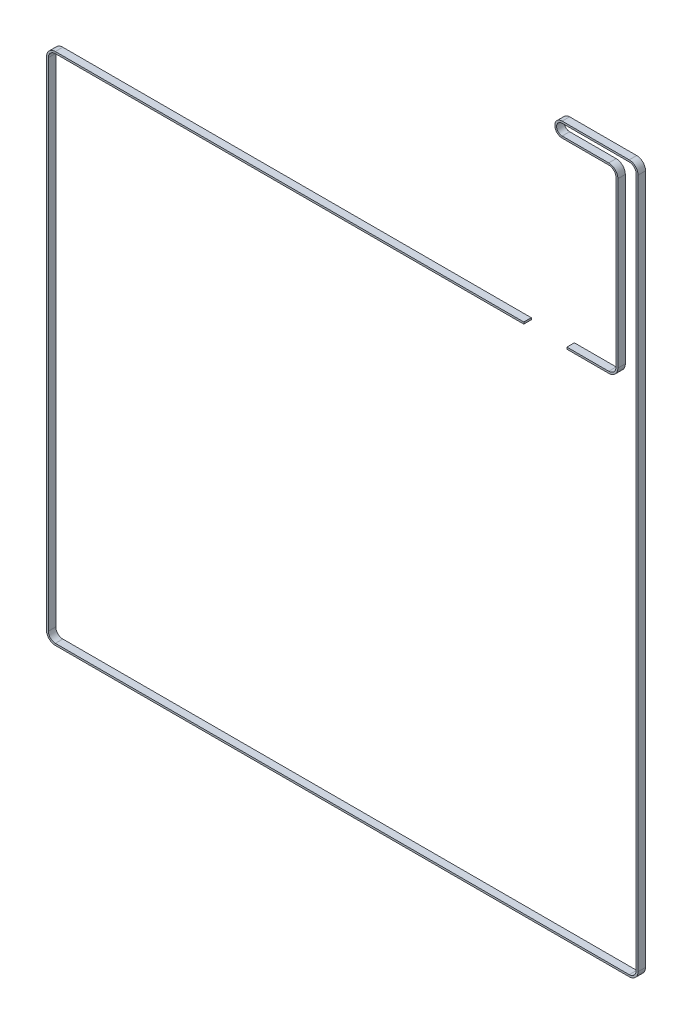
ISO-10303-21;
HEADER;
FILE_DESCRIPTION(('STEP AP214'),'2;1');
FILE_NAME('part.step','',(''),(''),'','','');
FILE_SCHEMA(('AUTOMOTIVE_DESIGN { 1 0 10303 214 1 1 1 1 }'));
ENDSEC;
DATA;
#1=APPLICATION_CONTEXT('core data for automotive mechanical design processes');
#2=APPLICATION_PROTOCOL_DEFINITION('international standard','automotive_design',2000,#1);
#3=PRODUCT_CONTEXT('',#1,'mechanical');
#4=PRODUCT('Part','Part','',(#3));
#5=PRODUCT_RELATED_PRODUCT_CATEGORY('part','',(#4));
#6=PRODUCT_DEFINITION_FORMATION('','',#4);
#7=PRODUCT_DEFINITION_CONTEXT('part definition',#1,'design');
#8=PRODUCT_DEFINITION('design','',#6,#7);
#9=PRODUCT_DEFINITION_SHAPE('','',#8);
#10=(LENGTH_UNIT() NAMED_UNIT(*) SI_UNIT(.MILLI.,.METRE.));
#11=(NAMED_UNIT(*) PLANE_ANGLE_UNIT() SI_UNIT($,.RADIAN.));
#12=(NAMED_UNIT(*) SI_UNIT($,.STERADIAN.) SOLID_ANGLE_UNIT());
#13=UNCERTAINTY_MEASURE_WITH_UNIT(LENGTH_MEASURE(1.E-05),#10,'distance_accuracy_value','');
#14=(GEOMETRIC_REPRESENTATION_CONTEXT(3) GLOBAL_UNCERTAINTY_ASSIGNED_CONTEXT((#13)) GLOBAL_UNIT_ASSIGNED_CONTEXT((#10,
#11,#12)) REPRESENTATION_CONTEXT('',''));
#15=CARTESIAN_POINT('',(0.,0.,0.));
#16=DIRECTION('',(0.,0.,1.));
#17=DIRECTION('',(1.,0.,0.));
#18=AXIS2_PLACEMENT_3D('',#15,#16,#17);
#19=CARTESIAN_POINT('',(381.149458047137,-0.149999999995043,0.));
#20=DIRECTION('',(1.,0.,0.));
#21=DIRECTION('',(0.,0.,-1.));
#22=AXIS2_PLACEMENT_3D('',#19,#20,#21);
#23=PLANE('',#22);
#24=DIRECTION('',(0.,0.,1.));
#25=VECTOR('',#24,1.);
#26=CARTESIAN_POINT('',(381.149458047137,-297.175530774347,-3.));
#27=LINE('',#26,#25);
#28=CARTESIAN_POINT('',(381.149458047137,-297.175530774347,-3.));
#29=VERTEX_POINT('',#28);
#30=CARTESIAN_POINT('',(381.149458047137,-297.175530774347,3.));
#31=VERTEX_POINT('',#30);
#32=EDGE_CURVE('E215',#29,#31,#27,.T.);
#33=ORIENTED_EDGE('',*,*,#32,.F.);
#34=DIRECTION('',(0.,1.,0.));
#35=VECTOR('',#34,1.);
#36=CARTESIAN_POINT('',(381.149458047137,-298.675530774347,-3.));
#37=LINE('',#36,#35);
#38=CARTESIAN_POINT('',(381.149458047137,-298.675530774347,-3.));
#39=VERTEX_POINT('',#38);
#40=EDGE_CURVE('E211',#39,#29,#37,.T.);
#41=ORIENTED_EDGE('',*,*,#40,.F.);
#42=DIRECTION('',(0.,0.,-1.));
#43=VECTOR('',#42,1.);
#44=CARTESIAN_POINT('',(381.149458047137,-298.675530774347,-3.));
#45=LINE('',#44,#43);
#46=CARTESIAN_POINT('',(381.149458047137,-298.675530774347,3.));
#47=VERTEX_POINT('',#46);
#48=EDGE_CURVE('E339',#47,#39,#45,.T.);
#49=ORIENTED_EDGE('',*,*,#48,.F.);
#50=DIRECTION('',(0.,1.,0.));
#51=VECTOR('',#50,1.);
#52=CARTESIAN_POINT('',(381.149458047137,-0.149999999995043,3.));
#53=LINE('',#52,#51);
#54=EDGE_CURVE('E334',#31,#47,#53,.F.);
#55=ORIENTED_EDGE('',*,*,#54,.F.);
#56=EDGE_LOOP('',(#33,#41,#49,#55));
#57=FACE_BOUND('',#56,.T.);
#58=ADVANCED_FACE('F17',(#57),#23,.F.);
#59=CARTESIAN_POINT('',(381.149458047137,-297.175530774347,-3.));
#60=DIRECTION('',(0.,1.,0.));
#61=DIRECTION('',(0.,0.,1.));
#62=AXIS2_PLACEMENT_3D('',#59,#60,#61);
#63=PLANE('',#62);
#64=DIRECTION('',(1.,0.,0.));
#65=VECTOR('',#64,1.);
#66=CARTESIAN_POINT('',(381.149458047137,-297.175530774347,-3.));
#67=LINE('',#66,#65);
#68=CARTESIAN_POINT('',(414.812225958661,-297.175530774347,-3.));
#69=VERTEX_POINT('',#68);
#70=EDGE_CURVE('E203',#69,#29,#67,.F.);
#71=ORIENTED_EDGE('',*,*,#70,.T.);
#72=ORIENTED_EDGE('',*,*,#32,.T.);
#73=DIRECTION('',(1.,0.,0.));
#74=VECTOR('',#73,1.);
#75=CARTESIAN_POINT('',(381.149458047137,-297.175530774347,3.));
#76=LINE('',#75,#74);
#77=CARTESIAN_POINT('',(414.812225958661,-297.175530774347,3.));
#78=VERTEX_POINT('',#77);
#79=EDGE_CURVE('E216',#31,#78,#76,.T.);
#80=ORIENTED_EDGE('',*,*,#79,.T.);
#81=DIRECTION('',(0.,0.,1.));
#82=VECTOR('',#81,1.);
#83=CARTESIAN_POINT('',(414.812225958661,-297.175530774347,0.));
#84=LINE('',#83,#82);
#85=EDGE_CURVE('E219',#78,#69,#84,.F.);
#86=ORIENTED_EDGE('',*,*,#85,.T.);
#87=EDGE_LOOP('',(#71,#72,#80,#86));
#88=FACE_BOUND('',#87,.T.);
#89=ADVANCED_FACE('F220',(#88),#63,.T.);
#90=CARTESIAN_POINT('',(381.149458047137,-298.675530774347,-3.));
#91=DIRECTION('',(0.,-1.,0.));
#92=DIRECTION('',(0.,0.,-1.));
#93=AXIS2_PLACEMENT_3D('',#90,#91,#92);
#94=PLANE('',#93);
#95=ORIENTED_EDGE('',*,*,#48,.T.);
#96=DIRECTION('',(1.,0.,0.));
#97=VECTOR('',#96,1.);
#98=CARTESIAN_POINT('',(381.149458047137,-298.675530774347,-3.));
#99=LINE('',#98,#97);
#100=CARTESIAN_POINT('',(414.812225958661,-298.675530774347,-3.));
#101=VERTEX_POINT('',#100);
#102=EDGE_CURVE('E225',#39,#101,#99,.T.);
#103=ORIENTED_EDGE('',*,*,#102,.T.);
#104=DIRECTION('',(0.,0.,1.));
#105=VECTOR('',#104,1.);
#106=CARTESIAN_POINT('',(414.812225958661,-298.675530774347,0.));
#107=LINE('',#106,#105);
#108=CARTESIAN_POINT('',(414.812225958661,-298.675530774347,3.));
#109=VERTEX_POINT('',#108);
#110=EDGE_CURVE('E235',#109,#101,#107,.F.);
#111=ORIENTED_EDGE('',*,*,#110,.F.);
#112=DIRECTION('',(1.,0.,0.));
#113=VECTOR('',#112,1.);
#114=CARTESIAN_POINT('',(381.149458047137,-298.675530774347,3.));
#115=LINE('',#114,#113);
#116=EDGE_CURVE('E331',#109,#47,#115,.F.);
#117=ORIENTED_EDGE('',*,*,#116,.T.);
#118=EDGE_LOOP('',(#95,#103,#111,#117));
#119=FACE_BOUND('',#118,.T.);
#120=ADVANCED_FACE('F579',(#119),#94,.T.);
#121=CARTESIAN_POINT('',(414.812225958661,-291.32553077435,0.));
#122=DIRECTION('',(0.,0.,1.));
#123=DIRECTION('',(1.,0.,0.));
#124=AXIS2_PLACEMENT_3D('',#121,#122,#123);
#125=CYLINDRICAL_SURFACE('',#124,5.84999999999686);
#126=DIRECTION('',(0.,0.,1.));
#127=VECTOR('',#126,1.);
#128=CARTESIAN_POINT('',(420.662225958658,-291.32553077435,-3.));
#129=LINE('',#128,#127);
#130=CARTESIAN_POINT('',(420.662225958658,-291.32553077435,-3.));
#131=VERTEX_POINT('',#130);
#132=CARTESIAN_POINT('',(420.662225958658,-291.32553077435,3.));
#133=VERTEX_POINT('',#132);
#134=EDGE_CURVE('E229',#131,#133,#129,.T.);
#135=ORIENTED_EDGE('',*,*,#134,.F.);
#136=CARTESIAN_POINT('',(414.812225958661,-291.32553077435,-3.));
#137=DIRECTION('',(0.,0.,1.));
#138=DIRECTION('',(1.,0.,0.));
#139=AXIS2_PLACEMENT_3D('',#136,#137,#138);
#140=CIRCLE('',#139,5.84999999999686);
#141=EDGE_CURVE('E20',#69,#131,#140,.T.);
#142=ORIENTED_EDGE('',*,*,#141,.F.);
#143=ORIENTED_EDGE('',*,*,#85,.F.);
#144=CARTESIAN_POINT('',(414.812225958661,-291.32553077435,3.));
#145=DIRECTION('',(0.,0.,1.));
#146=DIRECTION('',(1.,0.,0.));
#147=AXIS2_PLACEMENT_3D('',#144,#145,#146);
#148=CIRCLE('',#147,5.84999999999686);
#149=EDGE_CURVE('E231',#133,#78,#148,.F.);
#150=ORIENTED_EDGE('',*,*,#149,.F.);
#151=EDGE_LOOP('',(#135,#142,#143,#150));
#152=FACE_BOUND('',#151,.T.);
#153=ADVANCED_FACE('F227',(#152),#125,.F.);
#154=CARTESIAN_POINT('',(414.812225958661,-291.32553077435,0.));
#155=DIRECTION('',(0.,0.,1.));
#156=DIRECTION('',(1.,0.,0.));
#157=AXIS2_PLACEMENT_3D('',#154,#155,#156);
#158=CYLINDRICAL_SURFACE('',#157,7.3499999999968);
#159=ORIENTED_EDGE('',*,*,#110,.T.);
#160=CARTESIAN_POINT('',(414.812225958661,-291.32553077435,-3.));
#161=DIRECTION('',(0.,0.,1.));
#162=DIRECTION('',(1.,0.,0.));
#163=AXIS2_PLACEMENT_3D('',#160,#161,#162);
#164=CIRCLE('',#163,7.3499999999968);
#165=CARTESIAN_POINT('',(422.162225958658,-291.32553077435,-3.));
#166=VERTEX_POINT('',#165);
#167=EDGE_CURVE('E238',#101,#166,#164,.T.);
#168=ORIENTED_EDGE('',*,*,#167,.T.);
#169=DIRECTION('',(0.,0.,1.));
#170=VECTOR('',#169,1.);
#171=CARTESIAN_POINT('',(422.162225958658,-291.32553077435,-3.));
#172=LINE('',#171,#170);
#173=CARTESIAN_POINT('',(422.162225958658,-291.32553077435,3.));
#174=VERTEX_POINT('',#173);
#175=EDGE_CURVE('E367',#174,#166,#172,.F.);
#176=ORIENTED_EDGE('',*,*,#175,.F.);
#177=CARTESIAN_POINT('',(414.812225958661,-291.32553077435,3.));
#178=DIRECTION('',(0.,0.,1.));
#179=DIRECTION('',(1.,0.,0.));
#180=AXIS2_PLACEMENT_3D('',#177,#178,#179);
#181=CIRCLE('',#180,7.3499999999968);
#182=EDGE_CURVE('E232',#174,#109,#181,.F.);
#183=ORIENTED_EDGE('',*,*,#182,.T.);
#184=EDGE_LOOP('',(#159,#168,#176,#183));
#185=FACE_BOUND('',#184,.T.);
#186=ADVANCED_FACE('F583',(#185),#158,.T.);
#187=CARTESIAN_POINT('',(420.662225958658,-291.32553077435,-3.));
#188=DIRECTION('',(-1.,0.,0.));
#189=DIRECTION('',(0.,-1.,0.));
#190=AXIS2_PLACEMENT_3D('',#187,#188,#189);
#191=PLANE('',#190);
#192=DIRECTION('',(0.,-1.,0.));
#193=VECTOR('',#192,1.);
#194=CARTESIAN_POINT('',(420.662225958658,-291.32553077435,-3.));
#195=LINE('',#194,#193);
#196=CARTESIAN_POINT('',(420.66222595866,-159.285411885022,-3.));
#197=VERTEX_POINT('',#196);
#198=EDGE_CURVE('E361',#197,#131,#195,.T.);
#199=ORIENTED_EDGE('',*,*,#198,.T.);
#200=ORIENTED_EDGE('',*,*,#134,.T.);
#201=DIRECTION('',(0.,-1.,0.));
#202=VECTOR('',#201,1.);
#203=CARTESIAN_POINT('',(420.662225958658,-291.32553077435,3.));
#204=LINE('',#203,#202);
#205=CARTESIAN_POINT('',(420.66222595866,-159.285411885022,3.));
#206=VERTEX_POINT('',#205);
#207=EDGE_CURVE('E240',#133,#206,#204,.F.);
#208=ORIENTED_EDGE('',*,*,#207,.T.);
#209=DIRECTION('',(0.,0.,1.));
#210=VECTOR('',#209,1.);
#211=CARTESIAN_POINT('',(420.66222595866,-159.285411885022,0.));
#212=LINE('',#211,#210);
#213=EDGE_CURVE('E244',#206,#197,#212,.F.);
#214=ORIENTED_EDGE('',*,*,#213,.T.);
#215=EDGE_LOOP('',(#199,#200,#208,#214));
#216=FACE_BOUND('',#215,.T.);
#217=ADVANCED_FACE('F691',(#216),#191,.T.);
#218=CARTESIAN_POINT('',(-30.68777404134,-297.025530774352,-3.));
#219=DIRECTION('',(0.,1.,0.));
#220=DIRECTION('',(0.,0.,1.));
#221=AXIS2_PLACEMENT_3D('',#218,#219,#220);
#222=PLANE('',#221);
#223=DIRECTION('',(-1.,0.,0.));
#224=VECTOR('',#223,1.);
#225=CARTESIAN_POINT('',(-30.68777404134,-297.025530774351,-3.));
#226=LINE('',#225,#224);
#227=CARTESIAN_POINT('',(-30.68777404134,-297.025530774351,-3.));
#228=VERTEX_POINT('',#227);
#229=CARTESIAN_POINT('',(346.449458047137,-297.025530774351,-3.));
#230=VERTEX_POINT('',#229);
#231=EDGE_CURVE('E378',#228,#230,#226,.F.);
#232=ORIENTED_EDGE('',*,*,#231,.F.);
#233=DIRECTION('',(0.,0.,-1.));
#234=VECTOR('',#233,1.);
#235=CARTESIAN_POINT('',(-30.68777404134,-297.025530774351,0.));
#236=LINE('',#235,#234);
#237=CARTESIAN_POINT('',(-30.68777404134,-297.025530774351,3.));
#238=VERTEX_POINT('',#237);
#239=EDGE_CURVE('E247',#238,#228,#236,.T.);
#240=ORIENTED_EDGE('',*,*,#239,.F.);
#241=DIRECTION('',(1.,0.,0.));
#242=VECTOR('',#241,1.);
#243=CARTESIAN_POINT('',(-30.68777404134,-297.025530774352,3.));
#244=LINE('',#243,#242);
#245=CARTESIAN_POINT('',(346.449458047137,-297.025530774352,3.));
#246=VERTEX_POINT('',#245);
#247=EDGE_CURVE('E382',#246,#238,#244,.F.);
#248=ORIENTED_EDGE('',*,*,#247,.F.);
#249=DIRECTION('',(0.,0.,-1.));
#250=VECTOR('',#249,1.);
#251=CARTESIAN_POINT('',(346.449458047137,-297.025530774352,0.));
#252=LINE('',#251,#250);
#253=EDGE_CURVE('E360',#230,#246,#252,.F.);
#254=ORIENTED_EDGE('',*,*,#253,.F.);
#255=EDGE_LOOP('',(#232,#240,#248,#254));
#256=FACE_BOUND('',#255,.T.);
#257=ADVANCED_FACE('F560',(#256),#222,.T.);
#258=CARTESIAN_POINT('',(346.449458047137,0.,0.));
#259=DIRECTION('',(1.,0.,0.));
#260=DIRECTION('',(0.,0.,-1.));
#261=AXIS2_PLACEMENT_3D('',#258,#259,#260);
#262=PLANE('',#261);
#263=DIRECTION('',(0.,1.,0.));
#264=VECTOR('',#263,1.);
#265=CARTESIAN_POINT('',(346.449458047137,-298.525530774352,-3.));
#266=LINE('',#265,#264);
#267=CARTESIAN_POINT('',(346.449458047137,-298.525530774352,-3.));
#268=VERTEX_POINT('',#267);
#269=EDGE_CURVE('E381',#230,#268,#266,.F.);
#270=ORIENTED_EDGE('',*,*,#269,.F.);
#271=ORIENTED_EDGE('',*,*,#253,.T.);
#272=DIRECTION('',(0.,1.,0.));
#273=VECTOR('',#272,1.);
#274=CARTESIAN_POINT('',(346.449458047137,-298.525530774352,3.));
#275=LINE('',#274,#273);
#276=CARTESIAN_POINT('',(346.449458047137,-298.525530774352,3.));
#277=VERTEX_POINT('',#276);
#278=EDGE_CURVE('E366',#277,#246,#275,.T.);
#279=ORIENTED_EDGE('',*,*,#278,.F.);
#280=DIRECTION('',(0.,0.,-1.));
#281=VECTOR('',#280,1.);
#282=CARTESIAN_POINT('',(346.449458047137,-298.525530774352,-3.));
#283=LINE('',#282,#281);
#284=EDGE_CURVE('E254',#268,#277,#283,.F.);
#285=ORIENTED_EDGE('',*,*,#284,.F.);
#286=EDGE_LOOP('',(#270,#271,#279,#285));
#287=FACE_BOUND('',#286,.T.);
#288=ADVANCED_FACE('F554',(#287),#262,.T.);
#289=CARTESIAN_POINT('',(422.162225958658,-291.32553077435,-3.));
#290=DIRECTION('',(1.,0.,0.));
#291=DIRECTION('',(0.,1.,0.));
#292=AXIS2_PLACEMENT_3D('',#289,#290,#291);
#293=PLANE('',#292);
#294=ORIENTED_EDGE('',*,*,#175,.T.);
#295=DIRECTION('',(0.,1.,0.));
#296=VECTOR('',#295,1.);
#297=CARTESIAN_POINT('',(422.162225958658,-291.32553077435,-3.));
#298=LINE('',#297,#296);
#299=CARTESIAN_POINT('',(422.16222595866,-159.285411885022,-3.));
#300=VERTEX_POINT('',#299);
#301=EDGE_CURVE('E370',#166,#300,#298,.T.);
#302=ORIENTED_EDGE('',*,*,#301,.T.);
#303=DIRECTION('',(0.,0.,1.));
#304=VECTOR('',#303,1.);
#305=CARTESIAN_POINT('',(422.16222595866,-159.285411885022,0.));
#306=LINE('',#305,#304);
#307=CARTESIAN_POINT('',(422.16222595866,-159.285411885022,3.));
#308=VERTEX_POINT('',#307);
#309=EDGE_CURVE('E258',#308,#300,#306,.F.);
#310=ORIENTED_EDGE('',*,*,#309,.F.);
#311=DIRECTION('',(0.,1.,0.));
#312=VECTOR('',#311,1.);
#313=CARTESIAN_POINT('',(422.162225958658,-291.32553077435,3.));
#314=LINE('',#313,#312);
#315=EDGE_CURVE('E371',#308,#174,#314,.F.);
#316=ORIENTED_EDGE('',*,*,#315,.T.);
#317=EDGE_LOOP('',(#294,#302,#310,#316));
#318=FACE_BOUND('',#317,.T.);
#319=ADVANCED_FACE('F587',(#318),#293,.T.);
#320=CARTESIAN_POINT('',(414.81222595866,-159.285411885022,0.));
#321=DIRECTION('',(0.,0.,1.));
#322=DIRECTION('',(1.,0.,0.));
#323=AXIS2_PLACEMENT_3D('',#320,#321,#322);
#324=CYLINDRICAL_SURFACE('',#323,5.85000000000024);
#325=DIRECTION('',(0.,0.,-1.));
#326=VECTOR('',#325,1.);
#327=CARTESIAN_POINT('',(414.81222595866,-153.435411885022,-3.));
#328=LINE('',#327,#326);
#329=CARTESIAN_POINT('',(414.81222595866,-153.435411885022,-3.));
#330=VERTEX_POINT('',#329);
#331=CARTESIAN_POINT('',(414.81222595866,-153.435411885022,3.));
#332=VERTEX_POINT('',#331);
#333=EDGE_CURVE('E407',#330,#332,#328,.F.);
#334=ORIENTED_EDGE('',*,*,#333,.F.);
#335=CARTESIAN_POINT('',(414.81222595866,-159.285411885022,-3.));
#336=DIRECTION('',(0.,0.,1.));
#337=DIRECTION('',(1.,0.,0.));
#338=AXIS2_PLACEMENT_3D('',#335,#336,#337);
#339=CIRCLE('',#338,5.85000000000024);
#340=EDGE_CURVE('E241',#197,#330,#339,.T.);
#341=ORIENTED_EDGE('',*,*,#340,.F.);
#342=ORIENTED_EDGE('',*,*,#213,.F.);
#343=CARTESIAN_POINT('',(414.81222595866,-159.285411885022,3.));
#344=DIRECTION('',(0.,0.,1.));
#345=DIRECTION('',(1.,0.,0.));
#346=AXIS2_PLACEMENT_3D('',#343,#344,#345);
#347=CIRCLE('',#346,5.85000000000024);
#348=EDGE_CURVE('E243',#332,#206,#347,.F.);
#349=ORIENTED_EDGE('',*,*,#348,.F.);
#350=EDGE_LOOP('',(#334,#341,#342,#349));
#351=FACE_BOUND('',#350,.T.);
#352=ADVANCED_FACE('F681',(#351),#324,.F.);
#353=CARTESIAN_POINT('',(-30.68777404134,-304.150530774351,0.));
#354=DIRECTION('',(0.,0.,-1.));
#355=DIRECTION('',(-1.,0.,0.));
#356=AXIS2_PLACEMENT_3D('',#353,#354,#355);
#357=CYLINDRICAL_SURFACE('',#356,7.12499999999999);
#358=CARTESIAN_POINT('',(-30.68777404134,-304.150530774351,-3.));
#359=DIRECTION('',(0.,0.,-1.));
#360=DIRECTION('',(-1.,0.,0.));
#361=AXIS2_PLACEMENT_3D('',#358,#359,#360);
#362=CIRCLE('',#361,7.12499999999999);
#363=CARTESIAN_POINT('',(-37.8127740413403,-304.150530774351,-3.));
#364=VERTEX_POINT('',#363);
#365=EDGE_CURVE('E248',#364,#228,#362,.T.);
#366=ORIENTED_EDGE('',*,*,#365,.F.);
#367=DIRECTION('',(0.,0.,1.));
#368=VECTOR('',#367,1.);
#369=CARTESIAN_POINT('',(-37.8127740413406,-304.150530774351,-3.));
#370=LINE('',#369,#368);
#371=CARTESIAN_POINT('',(-37.8127740413403,-304.150530774351,3.));
#372=VERTEX_POINT('',#371);
#373=EDGE_CURVE('E266',#372,#364,#370,.F.);
#374=ORIENTED_EDGE('',*,*,#373,.F.);
#375=CARTESIAN_POINT('',(-30.68777404134,-304.150530774351,3.));
#376=DIRECTION('',(0.,0.,-1.));
#377=DIRECTION('',(-1.,0.,0.));
#378=AXIS2_PLACEMENT_3D('',#375,#376,#377);
#379=CIRCLE('',#378,7.12499999999999);
#380=EDGE_CURVE('E251',#238,#372,#379,.F.);
#381=ORIENTED_EDGE('',*,*,#380,.F.);
#382=ORIENTED_EDGE('',*,*,#239,.T.);
#383=EDGE_LOOP('',(#366,#374,#381,#382));
#384=FACE_BOUND('',#383,.T.);
#385=ADVANCED_FACE('F564',(#384),#357,.T.);
#386=CARTESIAN_POINT('',(-30.68777404134,-298.525530774352,-3.));
#387=DIRECTION('',(0.,-1.,0.));
#388=DIRECTION('',(0.,0.,-1.));
#389=AXIS2_PLACEMENT_3D('',#386,#387,#388);
#390=PLANE('',#389);
#391=DIRECTION('',(0.,0.,-1.));
#392=VECTOR('',#391,1.);
#393=CARTESIAN_POINT('',(-30.68777404134,-298.525530774351,0.));
#394=LINE('',#393,#392);
#395=CARTESIAN_POINT('',(-30.68777404134,-298.525530774351,3.));
#396=VERTEX_POINT('',#395);
#397=CARTESIAN_POINT('',(-30.68777404134,-298.525530774351,-3.));
#398=VERTEX_POINT('',#397);
#399=EDGE_CURVE('E268',#396,#398,#394,.T.);
#400=ORIENTED_EDGE('',*,*,#399,.T.);
#401=DIRECTION('',(1.,0.,0.));
#402=VECTOR('',#401,1.);
#403=CARTESIAN_POINT('',(-30.68777404134,-298.525530774352,-3.));
#404=LINE('',#403,#402);
#405=EDGE_CURVE('E259',#398,#268,#404,.T.);
#406=ORIENTED_EDGE('',*,*,#405,.T.);
#407=ORIENTED_EDGE('',*,*,#284,.T.);
#408=DIRECTION('',(1.,0.,0.));
#409=VECTOR('',#408,1.);
#410=CARTESIAN_POINT('',(-30.68777404134,-298.525530774352,3.));
#411=LINE('',#410,#409);
#412=EDGE_CURVE('E397',#277,#396,#411,.F.);
#413=ORIENTED_EDGE('',*,*,#412,.T.);
#414=EDGE_LOOP('',(#400,#406,#407,#413));
#415=FACE_BOUND('',#414,.T.);
#416=ADVANCED_FACE('F548',(#415),#390,.T.);
#417=CARTESIAN_POINT('',(414.81222595866,-159.285411885022,0.));
#418=DIRECTION('',(0.,0.,1.));
#419=DIRECTION('',(1.,0.,0.));
#420=AXIS2_PLACEMENT_3D('',#417,#418,#419);
#421=CYLINDRICAL_SURFACE('',#420,7.35000000000019);
#422=ORIENTED_EDGE('',*,*,#309,.T.);
#423=CARTESIAN_POINT('',(414.81222595866,-159.285411885022,-3.));
#424=DIRECTION('',(0.,0.,1.));
#425=DIRECTION('',(1.,0.,0.));
#426=AXIS2_PLACEMENT_3D('',#423,#424,#425);
#427=CIRCLE('',#426,7.35000000000019);
#428=CARTESIAN_POINT('',(414.81222595866,-151.935411885022,-3.));
#429=VERTEX_POINT('',#428);
#430=EDGE_CURVE('E260',#300,#429,#427,.T.);
#431=ORIENTED_EDGE('',*,*,#430,.T.);
#432=DIRECTION('',(0.,0.,1.));
#433=VECTOR('',#432,1.);
#434=CARTESIAN_POINT('',(414.81222595866,-151.935411885022,-3.));
#435=LINE('',#434,#433);
#436=CARTESIAN_POINT('',(414.81222595866,-151.935411885022,3.));
#437=VERTEX_POINT('',#436);
#438=EDGE_CURVE('E424',#437,#429,#435,.F.);
#439=ORIENTED_EDGE('',*,*,#438,.F.);
#440=CARTESIAN_POINT('',(414.81222595866,-159.285411885022,3.));
#441=DIRECTION('',(0.,0.,1.));
#442=DIRECTION('',(1.,0.,0.));
#443=AXIS2_PLACEMENT_3D('',#440,#441,#442);
#444=CIRCLE('',#443,7.35000000000019);
#445=EDGE_CURVE('E255',#437,#308,#444,.F.);
#446=ORIENTED_EDGE('',*,*,#445,.T.);
#447=EDGE_LOOP('',(#422,#431,#439,#446));
#448=FACE_BOUND('',#447,.T.);
#449=ADVANCED_FACE('F591',(#448),#421,.T.);
#450=CARTESIAN_POINT('',(414.81222595866,-153.435411885022,-3.));
#451=DIRECTION('',(0.,-1.,0.));
#452=DIRECTION('',(0.,0.,-1.));
#453=AXIS2_PLACEMENT_3D('',#450,#451,#452);
#454=PLANE('',#453);
#455=DIRECTION('',(1.,0.,0.));
#456=VECTOR('',#455,1.);
#457=CARTESIAN_POINT('',(414.81222595866,-153.435411885022,-3.));
#458=LINE('',#457,#456);
#459=CARTESIAN_POINT('',(377.31222595866,-153.435411885022,-3.));
#460=VERTEX_POINT('',#459);
#461=EDGE_CURVE('E410',#460,#330,#458,.T.);
#462=ORIENTED_EDGE('',*,*,#461,.T.);
#463=ORIENTED_EDGE('',*,*,#333,.T.);
#464=DIRECTION('',(1.,0.,0.));
#465=VECTOR('',#464,1.);
#466=CARTESIAN_POINT('',(414.81222595866,-153.435411885022,3.));
#467=LINE('',#466,#465);
#468=CARTESIAN_POINT('',(377.31222595866,-153.435411885022,3.));
#469=VERTEX_POINT('',#468);
#470=EDGE_CURVE('E262',#332,#469,#467,.F.);
#471=ORIENTED_EDGE('',*,*,#470,.T.);
#472=DIRECTION('',(0.,0.,-1.));
#473=VECTOR('',#472,1.);
#474=CARTESIAN_POINT('',(377.31222595866,-153.435411885022,0.));
#475=LINE('',#474,#473);
#476=EDGE_CURVE('E439',#460,#469,#475,.F.);
#477=ORIENTED_EDGE('',*,*,#476,.F.);
#478=EDGE_LOOP('',(#462,#463,#471,#477));
#479=FACE_BOUND('',#478,.T.);
#480=ADVANCED_FACE('F660',(#479),#454,.T.);
#481=CARTESIAN_POINT('',(-37.8127740413406,-703.985411885021,-3.));
#482=DIRECTION('',(-1.,0.,0.));
#483=DIRECTION('',(0.,0.,1.));
#484=AXIS2_PLACEMENT_3D('',#481,#482,#483);
#485=PLANE('',#484);
#486=DIRECTION('',(0.,1.,0.));
#487=VECTOR('',#486,1.);
#488=CARTESIAN_POINT('',(-37.8127740413406,-703.985411885021,-3.));
#489=LINE('',#488,#487);
#490=CARTESIAN_POINT('',(-37.8127740413406,-703.985411885021,-3.));
#491=VERTEX_POINT('',#490);
#492=EDGE_CURVE('E432',#491,#364,#489,.T.);
#493=ORIENTED_EDGE('',*,*,#492,.F.);
#494=DIRECTION('',(0.,0.,-1.));
#495=VECTOR('',#494,1.);
#496=CARTESIAN_POINT('',(-37.8127740413406,-703.985411885021,0.));
#497=LINE('',#496,#495);
#498=CARTESIAN_POINT('',(-37.8127740413406,-703.985411885021,3.));
#499=VERTEX_POINT('',#498);
#500=EDGE_CURVE('E273',#499,#491,#497,.T.);
#501=ORIENTED_EDGE('',*,*,#500,.F.);
#502=DIRECTION('',(0.,1.,0.));
#503=VECTOR('',#502,1.);
#504=CARTESIAN_POINT('',(-37.8127740413405,-703.985411885021,3.));
#505=LINE('',#504,#503);
#506=EDGE_CURVE('E417',#372,#499,#505,.F.);
#507=ORIENTED_EDGE('',*,*,#506,.F.);
#508=ORIENTED_EDGE('',*,*,#373,.T.);
#509=EDGE_LOOP('',(#493,#501,#507,#508));
#510=FACE_BOUND('',#509,.T.);
#511=ADVANCED_FACE('F605',(#510),#485,.T.);
#512=CARTESIAN_POINT('',(-30.68777404134,-304.150530774351,0.));
#513=DIRECTION('',(0.,0.,-1.));
#514=DIRECTION('',(-1.,0.,0.));
#515=AXIS2_PLACEMENT_3D('',#512,#513,#514);
#516=CYLINDRICAL_SURFACE('',#515,5.62499999999999);
#517=CARTESIAN_POINT('',(-30.68777404134,-304.150530774351,3.));
#518=DIRECTION('',(0.,0.,-1.));
#519=DIRECTION('',(-1.,0.,0.));
#520=AXIS2_PLACEMENT_3D('',#517,#518,#519);
#521=CIRCLE('',#520,5.62499999999999);
#522=CARTESIAN_POINT('',(-36.3127740413403,-304.150530774351,3.));
#523=VERTEX_POINT('',#522);
#524=EDGE_CURVE('E265',#523,#396,#521,.T.);
#525=ORIENTED_EDGE('',*,*,#524,.F.);
#526=DIRECTION('',(0.,0.,-1.));
#527=VECTOR('',#526,1.);
#528=CARTESIAN_POINT('',(-36.3127740413406,-304.150530774351,-3.));
#529=LINE('',#528,#527);
#530=CARTESIAN_POINT('',(-36.3127740413403,-304.150530774351,-3.));
#531=VERTEX_POINT('',#530);
#532=EDGE_CURVE('E276',#531,#523,#529,.F.);
#533=ORIENTED_EDGE('',*,*,#532,.F.);
#534=CARTESIAN_POINT('',(-30.68777404134,-304.150530774351,-3.));
#535=DIRECTION('',(0.,0.,-1.));
#536=DIRECTION('',(-1.,0.,0.));
#537=AXIS2_PLACEMENT_3D('',#534,#535,#536);
#538=CIRCLE('',#537,5.62499999999999);
#539=EDGE_CURVE('E263',#398,#531,#538,.F.);
#540=ORIENTED_EDGE('',*,*,#539,.F.);
#541=ORIENTED_EDGE('',*,*,#399,.F.);
#542=EDGE_LOOP('',(#525,#533,#540,#541));
#543=FACE_BOUND('',#542,.T.);
#544=ADVANCED_FACE('F544',(#543),#516,.F.);
#545=CARTESIAN_POINT('',(414.81222595866,-151.935411885022,-3.));
#546=DIRECTION('',(0.,1.,0.));
#547=DIRECTION('',(0.,0.,1.));
#548=AXIS2_PLACEMENT_3D('',#545,#546,#547);
#549=PLANE('',#548);
#550=ORIENTED_EDGE('',*,*,#438,.T.);
#551=DIRECTION('',(1.,0.,0.));
#552=VECTOR('',#551,1.);
#553=CARTESIAN_POINT('',(414.81222595866,-151.935411885022,-3.));
#554=LINE('',#553,#552);
#555=CARTESIAN_POINT('',(377.31222595866,-151.935411885022,-3.));
#556=VERTEX_POINT('',#555);
#557=EDGE_CURVE('E427',#429,#556,#554,.F.);
#558=ORIENTED_EDGE('',*,*,#557,.T.);
#559=DIRECTION('',(0.,0.,-1.));
#560=VECTOR('',#559,1.);
#561=CARTESIAN_POINT('',(377.31222595866,-151.935411885022,0.));
#562=LINE('',#561,#560);
#563=CARTESIAN_POINT('',(377.31222595866,-151.935411885022,3.));
#564=VERTEX_POINT('',#563);
#565=EDGE_CURVE('E280',#556,#564,#562,.F.);
#566=ORIENTED_EDGE('',*,*,#565,.T.);
#567=DIRECTION('',(1.,0.,0.));
#568=VECTOR('',#567,1.);
#569=CARTESIAN_POINT('',(414.81222595866,-151.935411885022,3.));
#570=LINE('',#569,#568);
#571=EDGE_CURVE('E428',#564,#437,#570,.T.);
#572=ORIENTED_EDGE('',*,*,#571,.T.);
#573=EDGE_LOOP('',(#550,#558,#566,#572));
#574=FACE_BOUND('',#573,.T.);
#575=ADVANCED_FACE('F593',(#574),#549,.T.);
#576=CARTESIAN_POINT('',(-30.6877740413405,-703.985411885021,0.));
#577=DIRECTION('',(0.,0.,-1.));
#578=DIRECTION('',(-1.,0.,0.));
#579=AXIS2_PLACEMENT_3D('',#576,#577,#578);
#580=CYLINDRICAL_SURFACE('',#579,7.12500000000005);
#581=CARTESIAN_POINT('',(-30.6877740413405,-703.985411885021,-3.));
#582=DIRECTION('',(0.,0.,-1.));
#583=DIRECTION('',(-1.,0.,0.));
#584=AXIS2_PLACEMENT_3D('',#581,#582,#583);
#585=CIRCLE('',#584,7.12500000000005);
#586=CARTESIAN_POINT('',(-30.6877740413405,-711.110411885021,-3.));
#587=VERTEX_POINT('',#586);
#588=EDGE_CURVE('E269',#587,#491,#585,.T.);
#589=ORIENTED_EDGE('',*,*,#588,.F.);
#590=DIRECTION('',(0.,0.,-1.));
#591=VECTOR('',#590,1.);
#592=CARTESIAN_POINT('',(-30.6877740413405,-711.110411885021,-3.));
#593=LINE('',#592,#591);
#594=CARTESIAN_POINT('',(-30.6877740413405,-711.110411885021,3.));
#595=VERTEX_POINT('',#594);
#596=EDGE_CURVE('E285',#595,#587,#593,.T.);
#597=ORIENTED_EDGE('',*,*,#596,.F.);
#598=CARTESIAN_POINT('',(-30.6877740413405,-703.985411885021,3.));
#599=DIRECTION('',(0.,0.,-1.));
#600=DIRECTION('',(-1.,0.,0.));
#601=AXIS2_PLACEMENT_3D('',#598,#599,#600);
#602=CIRCLE('',#601,7.12500000000005);
#603=EDGE_CURVE('E272',#499,#595,#602,.F.);
#604=ORIENTED_EDGE('',*,*,#603,.F.);
#605=ORIENTED_EDGE('',*,*,#500,.T.);
#606=EDGE_LOOP('',(#589,#597,#604,#605));
#607=FACE_BOUND('',#606,.T.);
#608=ADVANCED_FACE('F595',(#607),#580,.T.);
#609=CARTESIAN_POINT('',(377.31222595866,-147.485411885022,0.));
#610=DIRECTION('',(0.,0.,-1.));
#611=DIRECTION('',(-1.,0.,0.));
#612=AXIS2_PLACEMENT_3D('',#609,#610,#611);
#613=CYLINDRICAL_SURFACE('',#612,5.94999999999995);
#614=DIRECTION('',(0.,0.,1.));
#615=VECTOR('',#614,1.);
#616=CARTESIAN_POINT('',(377.31222595866,-141.535411885022,-3.));
#617=LINE('',#616,#615);
#618=CARTESIAN_POINT('',(377.31222595866,-141.535411885022,-3.));
#619=VERTEX_POINT('',#618);
#620=CARTESIAN_POINT('',(377.31222595866,-141.535411885022,3.));
#621=VERTEX_POINT('',#620);
#622=EDGE_CURVE('E289',#619,#621,#617,.T.);
#623=ORIENTED_EDGE('',*,*,#622,.F.);
#624=CARTESIAN_POINT('',(377.31222595866,-147.485411885022,-3.));
#625=DIRECTION('',(0.,0.,-1.));
#626=DIRECTION('',(-1.,0.,0.));
#627=AXIS2_PLACEMENT_3D('',#624,#625,#626);
#628=CIRCLE('',#627,5.94999999999995);
#629=EDGE_CURVE('E277',#460,#619,#628,.T.);
#630=ORIENTED_EDGE('',*,*,#629,.F.);
#631=ORIENTED_EDGE('',*,*,#476,.T.);
#632=CARTESIAN_POINT('',(377.31222595866,-147.485411885022,3.));
#633=DIRECTION('',(0.,0.,-1.));
#634=DIRECTION('',(-1.,0.,0.));
#635=AXIS2_PLACEMENT_3D('',#632,#633,#634);
#636=CIRCLE('',#635,5.94999999999995);
#637=EDGE_CURVE('E282',#621,#469,#636,.F.);
#638=ORIENTED_EDGE('',*,*,#637,.F.);
#639=EDGE_LOOP('',(#623,#630,#631,#638));
#640=FACE_BOUND('',#639,.T.);
#641=ADVANCED_FACE('F602',(#640),#613,.T.);
#642=CARTESIAN_POINT('',(-36.3127740413406,-703.985411885021,-3.));
#643=DIRECTION('',(1.,0.,0.));
#644=DIRECTION('',(0.,0.,-1.));
#645=AXIS2_PLACEMENT_3D('',#642,#643,#644);
#646=PLANE('',#645);
#647=DIRECTION('',(0.,0.,-1.));
#648=VECTOR('',#647,1.);
#649=CARTESIAN_POINT('',(-36.3127740413406,-703.985411885021,0.));
#650=LINE('',#649,#648);
#651=CARTESIAN_POINT('',(-36.3127740413406,-703.985411885021,3.));
#652=VERTEX_POINT('',#651);
#653=CARTESIAN_POINT('',(-36.3127740413406,-703.985411885021,-3.));
#654=VERTEX_POINT('',#653);
#655=EDGE_CURVE('E291',#652,#654,#650,.T.);
#656=ORIENTED_EDGE('',*,*,#655,.T.);
#657=DIRECTION('',(0.,1.,0.));
#658=VECTOR('',#657,1.);
#659=CARTESIAN_POINT('',(-36.3127740413406,-703.985411885021,-3.));
#660=LINE('',#659,#658);
#661=EDGE_CURVE('E281',#654,#531,#660,.T.);
#662=ORIENTED_EDGE('',*,*,#661,.T.);
#663=ORIENTED_EDGE('',*,*,#532,.T.);
#664=DIRECTION('',(0.,1.,0.));
#665=VECTOR('',#664,1.);
#666=CARTESIAN_POINT('',(-36.3127740413405,-703.985411885021,3.));
#667=LINE('',#666,#665);
#668=EDGE_CURVE('E442',#523,#652,#667,.F.);
#669=ORIENTED_EDGE('',*,*,#668,.T.);
#670=EDGE_LOOP('',(#656,#662,#663,#669));
#671=FACE_BOUND('',#670,.T.);
#672=ADVANCED_FACE('F540',(#671),#646,.T.);
#673=CARTESIAN_POINT('',(431.31222595866,-711.110411885021,-3.));
#674=DIRECTION('',(0.,-1.,0.));
#675=DIRECTION('',(0.,0.,-1.));
#676=AXIS2_PLACEMENT_3D('',#673,#674,#675);
#677=PLANE('',#676);
#678=DIRECTION('',(-1.,0.,0.));
#679=VECTOR('',#678,1.);
#680=CARTESIAN_POINT('',(431.31222595866,-711.110411885021,-3.));
#681=LINE('',#680,#679);
#682=CARTESIAN_POINT('',(431.31222595866,-711.110411885021,-3.));
#683=VERTEX_POINT('',#682);
#684=EDGE_CURVE('E462',#683,#587,#681,.T.);
#685=ORIENTED_EDGE('',*,*,#684,.F.);
#686=DIRECTION('',(0.,0.,-1.));
#687=VECTOR('',#686,1.);
#688=CARTESIAN_POINT('',(431.31222595866,-711.110411885021,0.));
#689=LINE('',#688,#687);
#690=CARTESIAN_POINT('',(431.31222595866,-711.110411885021,3.));
#691=VERTEX_POINT('',#690);
#692=EDGE_CURVE('E469',#691,#683,#689,.T.);
#693=ORIENTED_EDGE('',*,*,#692,.F.);
#694=DIRECTION('',(1.,0.,0.));
#695=VECTOR('',#694,1.);
#696=CARTESIAN_POINT('',(431.31222595866,-711.110411885021,3.));
#697=LINE('',#696,#695);
#698=EDGE_CURVE('E455',#595,#691,#697,.T.);
#699=ORIENTED_EDGE('',*,*,#698,.F.);
#700=ORIENTED_EDGE('',*,*,#596,.T.);
#701=EDGE_LOOP('',(#685,#693,#699,#700));
#702=FACE_BOUND('',#701,.T.);
#703=ADVANCED_FACE('F643',(#702),#677,.T.);
#704=CARTESIAN_POINT('',(377.31222595866,-141.535411885022,-3.));
#705=DIRECTION('',(0.,1.,0.));
#706=DIRECTION('',(0.,0.,1.));
#707=AXIS2_PLACEMENT_3D('',#704,#705,#706);
#708=PLANE('',#707);
#709=DIRECTION('',(-1.,0.,0.));
#710=VECTOR('',#709,1.);
#711=CARTESIAN_POINT('',(377.31222595866,-141.535411885022,-3.));
#712=LINE('',#711,#710);
#713=CARTESIAN_POINT('',(431.31222595866,-141.535411885022,-3.));
#714=VERTEX_POINT('',#713);
#715=EDGE_CURVE('E297',#619,#714,#712,.F.);
#716=ORIENTED_EDGE('',*,*,#715,.F.);
#717=ORIENTED_EDGE('',*,*,#622,.T.);
#718=DIRECTION('',(1.,0.,0.));
#719=VECTOR('',#718,1.);
#720=CARTESIAN_POINT('',(377.31222595866,-141.535411885022,3.));
#721=LINE('',#720,#719);
#722=CARTESIAN_POINT('',(431.31222595866,-141.535411885022,3.));
#723=VERTEX_POINT('',#722);
#724=EDGE_CURVE('E295',#723,#621,#721,.F.);
#725=ORIENTED_EDGE('',*,*,#724,.F.);
#726=DIRECTION('',(0.,0.,-1.));
#727=VECTOR('',#726,1.);
#728=CARTESIAN_POINT('',(431.31222595866,-141.535411885022,0.));
#729=LINE('',#728,#727);
#730=EDGE_CURVE('E302',#714,#723,#729,.F.);
#731=ORIENTED_EDGE('',*,*,#730,.F.);
#732=EDGE_LOOP('',(#716,#717,#725,#731));
#733=FACE_BOUND('',#732,.T.);
#734=ADVANCED_FACE('F640',(#733),#708,.T.);
#735=CARTESIAN_POINT('',(-30.6877740413405,-703.985411885021,0.));
#736=DIRECTION('',(0.,0.,-1.));
#737=DIRECTION('',(-1.,0.,0.));
#738=AXIS2_PLACEMENT_3D('',#735,#736,#737);
#739=CYLINDRICAL_SURFACE('',#738,5.62500000000005);
#740=CARTESIAN_POINT('',(-30.6877740413405,-703.985411885021,3.));
#741=DIRECTION('',(0.,0.,-1.));
#742=DIRECTION('',(-1.,0.,0.));
#743=AXIS2_PLACEMENT_3D('',#740,#741,#742);
#744=CIRCLE('',#743,5.62500000000005);
#745=CARTESIAN_POINT('',(-30.6877740413405,-709.610411885021,3.));
#746=VERTEX_POINT('',#745);
#747=EDGE_CURVE('E288',#746,#652,#744,.T.);
#748=ORIENTED_EDGE('',*,*,#747,.F.);
#749=DIRECTION('',(0.,0.,1.));
#750=VECTOR('',#749,1.);
#751=CARTESIAN_POINT('',(-30.6877740413405,-709.610411885021,-3.));
#752=LINE('',#751,#750);
#753=CARTESIAN_POINT('',(-30.6877740413405,-709.610411885021,-3.));
#754=VERTEX_POINT('',#753);
#755=EDGE_CURVE('E305',#754,#746,#752,.T.);
#756=ORIENTED_EDGE('',*,*,#755,.F.);
#757=CARTESIAN_POINT('',(-30.6877740413405,-703.985411885021,-3.));
#758=DIRECTION('',(0.,0.,-1.));
#759=DIRECTION('',(-1.,0.,0.));
#760=AXIS2_PLACEMENT_3D('',#757,#758,#759);
#761=CIRCLE('',#760,5.62500000000005);
#762=EDGE_CURVE('E286',#654,#754,#761,.F.);
#763=ORIENTED_EDGE('',*,*,#762,.F.);
#764=ORIENTED_EDGE('',*,*,#655,.F.);
#765=EDGE_LOOP('',(#748,#756,#763,#764));
#766=FACE_BOUND('',#765,.T.);
#767=ADVANCED_FACE('F536',(#766),#739,.F.);
#768=CARTESIAN_POINT('',(377.31222595866,-147.485411885022,0.));
#769=DIRECTION('',(0.,0.,-1.));
#770=DIRECTION('',(-1.,0.,0.));
#771=AXIS2_PLACEMENT_3D('',#768,#769,#770);
#772=CYLINDRICAL_SURFACE('',#771,4.44999999999995);
#773=CARTESIAN_POINT('',(377.31222595866,-147.485411885022,3.));
#774=DIRECTION('',(0.,0.,-1.));
#775=DIRECTION('',(-1.,0.,0.));
#776=AXIS2_PLACEMENT_3D('',#773,#774,#775);
#777=CIRCLE('',#776,4.44999999999995);
#778=CARTESIAN_POINT('',(377.31222595866,-143.035411885022,3.));
#779=VERTEX_POINT('',#778);
#780=EDGE_CURVE('E294',#564,#779,#777,.T.);
#781=ORIENTED_EDGE('',*,*,#780,.F.);
#782=ORIENTED_EDGE('',*,*,#565,.F.);
#783=CARTESIAN_POINT('',(377.31222595866,-147.485411885022,-3.));
#784=DIRECTION('',(0.,0.,-1.));
#785=DIRECTION('',(-1.,0.,0.));
#786=AXIS2_PLACEMENT_3D('',#783,#784,#785);
#787=CIRCLE('',#786,4.44999999999995);
#788=CARTESIAN_POINT('',(377.31222595866,-143.035411885022,-3.));
#789=VERTEX_POINT('',#788);
#790=EDGE_CURVE('E292',#789,#556,#787,.F.);
#791=ORIENTED_EDGE('',*,*,#790,.F.);
#792=DIRECTION('',(0.,0.,-1.));
#793=VECTOR('',#792,1.);
#794=CARTESIAN_POINT('',(377.31222595866,-143.035411885022,-3.));
#795=LINE('',#794,#793);
#796=EDGE_CURVE('E477',#779,#789,#795,.T.);
#797=ORIENTED_EDGE('',*,*,#796,.F.);
#798=EDGE_LOOP('',(#781,#782,#791,#797));
#799=FACE_BOUND('',#798,.T.);
#800=ADVANCED_FACE('F521',(#799),#772,.F.);
#801=CARTESIAN_POINT('',(431.312225958661,-703.985411885022,0.));
#802=DIRECTION('',(0.,0.,-1.));
#803=DIRECTION('',(-1.,0.,0.));
#804=AXIS2_PLACEMENT_3D('',#801,#802,#803);
#805=CYLINDRICAL_SURFACE('',#804,7.12499999999905);
#806=CARTESIAN_POINT('',(431.312225958661,-703.985411885022,-3.));
#807=DIRECTION('',(0.,0.,-1.));
#808=DIRECTION('',(-1.,0.,0.));
#809=AXIS2_PLACEMENT_3D('',#806,#807,#808);
#810=CIRCLE('',#809,7.12499999999905);
#811=CARTESIAN_POINT('',(438.43722595866,-703.985411885022,-3.));
#812=VERTEX_POINT('',#811);
#813=EDGE_CURVE('E298',#812,#683,#810,.T.);
#814=ORIENTED_EDGE('',*,*,#813,.F.);
#815=DIRECTION('',(0.,0.,-1.));
#816=VECTOR('',#815,1.);
#817=CARTESIAN_POINT('',(438.43722595866,-703.985411885022,-3.));
#818=LINE('',#817,#816);
#819=CARTESIAN_POINT('',(438.43722595866,-703.985411885022,3.));
#820=VERTEX_POINT('',#819);
#821=EDGE_CURVE('E314',#820,#812,#818,.T.);
#822=ORIENTED_EDGE('',*,*,#821,.F.);
#823=CARTESIAN_POINT('',(431.312225958661,-703.985411885022,3.));
#824=DIRECTION('',(0.,0.,-1.));
#825=DIRECTION('',(-1.,0.,0.));
#826=AXIS2_PLACEMENT_3D('',#823,#824,#825);
#827=CIRCLE('',#826,7.12499999999905);
#828=EDGE_CURVE('E301',#691,#820,#827,.F.);
#829=ORIENTED_EDGE('',*,*,#828,.F.);
#830=ORIENTED_EDGE('',*,*,#692,.T.);
#831=EDGE_LOOP('',(#814,#822,#829,#830));
#832=FACE_BOUND('',#831,.T.);
#833=ADVANCED_FACE('F631',(#832),#805,.T.);
#834=CARTESIAN_POINT('',(431.31222595866,-148.660411885022,0.));
#835=DIRECTION('',(0.,0.,-1.));
#836=DIRECTION('',(-1.,0.,0.));
#837=AXIS2_PLACEMENT_3D('',#834,#835,#836);
#838=CYLINDRICAL_SURFACE('',#837,7.12499999999994);
#839=CARTESIAN_POINT('',(431.31222595866,-148.660411885022,-3.));
#840=DIRECTION('',(0.,0.,-1.));
#841=DIRECTION('',(-1.,0.,0.));
#842=AXIS2_PLACEMENT_3D('',#839,#840,#841);
#843=CIRCLE('',#842,7.12499999999994);
#844=CARTESIAN_POINT('',(438.43722595866,-148.660411885022,-3.));
#845=VERTEX_POINT('',#844);
#846=EDGE_CURVE('E306',#714,#845,#843,.T.);
#847=ORIENTED_EDGE('',*,*,#846,.F.);
#848=ORIENTED_EDGE('',*,*,#730,.T.);
#849=CARTESIAN_POINT('',(431.31222595866,-148.660411885022,3.));
#850=DIRECTION('',(0.,0.,-1.));
#851=DIRECTION('',(-1.,0.,0.));
#852=AXIS2_PLACEMENT_3D('',#849,#850,#851);
#853=CIRCLE('',#852,7.12499999999994);
#854=CARTESIAN_POINT('',(438.43722595866,-148.660411885022,3.));
#855=VERTEX_POINT('',#854);
#856=EDGE_CURVE('E311',#855,#723,#853,.F.);
#857=ORIENTED_EDGE('',*,*,#856,.F.);
#858=DIRECTION('',(0.,0.,-1.));
#859=VECTOR('',#858,1.);
#860=CARTESIAN_POINT('',(438.43722595866,-148.660411885022,-3.));
#861=LINE('',#860,#859);
#862=EDGE_CURVE('E319',#845,#855,#861,.F.);
#863=ORIENTED_EDGE('',*,*,#862,.F.);
#864=EDGE_LOOP('',(#847,#848,#857,#863));
#865=FACE_BOUND('',#864,.T.);
#866=ADVANCED_FACE('F628',(#865),#838,.T.);
#867=CARTESIAN_POINT('',(431.31222595866,-709.610411885021,-3.));
#868=DIRECTION('',(0.,1.,0.));
#869=DIRECTION('',(0.,0.,1.));
#870=AXIS2_PLACEMENT_3D('',#867,#868,#869);
#871=PLANE('',#870);
#872=DIRECTION('',(0.,0.,-1.));
#873=VECTOR('',#872,1.);
#874=CARTESIAN_POINT('',(431.31222595866,-709.610411885021,0.));
#875=LINE('',#874,#873);
#876=CARTESIAN_POINT('',(431.31222595866,-709.610411885021,3.));
#877=VERTEX_POINT('',#876);
#878=CARTESIAN_POINT('',(431.31222595866,-709.610411885021,-3.));
#879=VERTEX_POINT('',#878);
#880=EDGE_CURVE('E321',#877,#879,#875,.T.);
#881=ORIENTED_EDGE('',*,*,#880,.T.);
#882=DIRECTION('',(1.,0.,0.));
#883=VECTOR('',#882,1.);
#884=CARTESIAN_POINT('',(431.31222595866,-709.610411885021,-3.));
#885=LINE('',#884,#883);
#886=EDGE_CURVE('E310',#879,#754,#885,.F.);
#887=ORIENTED_EDGE('',*,*,#886,.T.);
#888=ORIENTED_EDGE('',*,*,#755,.T.);
#889=DIRECTION('',(1.,0.,0.));
#890=VECTOR('',#889,1.);
#891=CARTESIAN_POINT('',(431.31222595866,-709.610411885021,3.));
#892=LINE('',#891,#890);
#893=EDGE_CURVE('E474',#746,#877,#892,.T.);
#894=ORIENTED_EDGE('',*,*,#893,.T.);
#895=EDGE_LOOP('',(#881,#887,#888,#894));
#896=FACE_BOUND('',#895,.T.);
#897=ADVANCED_FACE('F532',(#896),#871,.T.);
#898=CARTESIAN_POINT('',(377.31222595866,-143.035411885022,-3.));
#899=DIRECTION('',(0.,-1.,0.));
#900=DIRECTION('',(0.,0.,-1.));
#901=AXIS2_PLACEMENT_3D('',#898,#899,#900);
#902=PLANE('',#901);
#903=ORIENTED_EDGE('',*,*,#796,.T.);
#904=DIRECTION('',(1.,0.,0.));
#905=VECTOR('',#904,1.);
#906=CARTESIAN_POINT('',(377.31222595866,-143.035411885022,-3.));
#907=LINE('',#906,#905);
#908=CARTESIAN_POINT('',(431.31222595866,-143.035411885022,-3.));
#909=VERTEX_POINT('',#908);
#910=EDGE_CURVE('E315',#789,#909,#907,.T.);
#911=ORIENTED_EDGE('',*,*,#910,.T.);
#912=DIRECTION('',(0.,0.,-1.));
#913=VECTOR('',#912,1.);
#914=CARTESIAN_POINT('',(431.31222595866,-143.035411885022,0.));
#915=LINE('',#914,#913);
#916=CARTESIAN_POINT('',(431.31222595866,-143.035411885022,3.));
#917=VERTEX_POINT('',#916);
#918=EDGE_CURVE('E323',#909,#917,#915,.F.);
#919=ORIENTED_EDGE('',*,*,#918,.T.);
#920=DIRECTION('',(1.,0.,0.));
#921=VECTOR('',#920,1.);
#922=CARTESIAN_POINT('',(377.31222595866,-143.035411885022,3.));
#923=LINE('',#922,#921);
#924=EDGE_CURVE('E309',#917,#779,#923,.F.);
#925=ORIENTED_EDGE('',*,*,#924,.T.);
#926=EDGE_LOOP('',(#903,#911,#919,#925));
#927=FACE_BOUND('',#926,.T.);
#928=ADVANCED_FACE('F511',(#927),#902,.T.);
#929=CARTESIAN_POINT('',(438.43722595866,-148.660411885022,-3.));
#930=DIRECTION('',(1.,0.,0.));
#931=DIRECTION('',(0.,0.,-1.));
#932=AXIS2_PLACEMENT_3D('',#929,#930,#931);
#933=PLANE('',#932);
#934=DIRECTION('',(0.,1.,0.));
#935=VECTOR('',#934,1.);
#936=CARTESIAN_POINT('',(438.43722595866,-148.660411885022,-3.));
#937=LINE('',#936,#935);
#938=EDGE_CURVE('E327',#845,#812,#937,.F.);
#939=ORIENTED_EDGE('',*,*,#938,.F.);
#940=ORIENTED_EDGE('',*,*,#862,.T.);
#941=DIRECTION('',(0.,1.,0.));
#942=VECTOR('',#941,1.);
#943=CARTESIAN_POINT('',(438.43722595866,-148.660411885022,3.));
#944=LINE('',#943,#942);
#945=EDGE_CURVE('E324',#820,#855,#944,.T.);
#946=ORIENTED_EDGE('',*,*,#945,.F.);
#947=ORIENTED_EDGE('',*,*,#821,.T.);
#948=EDGE_LOOP('',(#939,#940,#946,#947));
#949=FACE_BOUND('',#948,.T.);
#950=ADVANCED_FACE('F620',(#949),#933,.T.);
#951=CARTESIAN_POINT('',(431.312225958661,-703.985411885022,0.));
#952=DIRECTION('',(0.,0.,-1.));
#953=DIRECTION('',(-1.,0.,0.));
#954=AXIS2_PLACEMENT_3D('',#951,#952,#953);
#955=CYLINDRICAL_SURFACE('',#954,5.6249999999991);
#956=CARTESIAN_POINT('',(431.312225958661,-703.985411885022,3.));
#957=DIRECTION('',(0.,0.,-1.));
#958=DIRECTION('',(-1.,0.,0.));
#959=AXIS2_PLACEMENT_3D('',#956,#957,#958);
#960=CIRCLE('',#959,5.6249999999991);
#961=CARTESIAN_POINT('',(436.93722595866,-703.985411885022,3.));
#962=VERTEX_POINT('',#961);
#963=EDGE_CURVE('E318',#962,#877,#960,.T.);
#964=ORIENTED_EDGE('',*,*,#963,.F.);
#965=DIRECTION('',(0.,0.,1.));
#966=VECTOR('',#965,1.);
#967=CARTESIAN_POINT('',(436.93722595866,-703.985411885022,-3.));
#968=LINE('',#967,#966);
#969=CARTESIAN_POINT('',(436.93722595866,-703.985411885022,-3.));
#970=VERTEX_POINT('',#969);
#971=EDGE_CURVE('E484',#970,#962,#968,.T.);
#972=ORIENTED_EDGE('',*,*,#971,.F.);
#973=CARTESIAN_POINT('',(431.312225958661,-703.985411885022,-3.));
#974=DIRECTION('',(0.,0.,-1.));
#975=DIRECTION('',(-1.,0.,0.));
#976=AXIS2_PLACEMENT_3D('',#973,#974,#975);
#977=CIRCLE('',#976,5.6249999999991);
#978=EDGE_CURVE('E316',#879,#970,#977,.F.);
#979=ORIENTED_EDGE('',*,*,#978,.F.);
#980=ORIENTED_EDGE('',*,*,#880,.F.);
#981=EDGE_LOOP('',(#964,#972,#979,#980));
#982=FACE_BOUND('',#981,.T.);
#983=ADVANCED_FACE('F528',(#982),#955,.F.);
#984=CARTESIAN_POINT('',(436.93722595866,-148.660411885022,3.));
#985=DIRECTION('',(0.,0.,1.));
#986=DIRECTION('',(1.,0.,0.));
#987=AXIS2_PLACEMENT_3D('',#984,#985,#986);
#988=PLANE('',#987);
#989=ORIENTED_EDGE('',*,*,#945,.T.);
#990=ORIENTED_EDGE('',*,*,#856,.T.);
#991=ORIENTED_EDGE('',*,*,#724,.T.);
#992=ORIENTED_EDGE('',*,*,#637,.T.);
#993=ORIENTED_EDGE('',*,*,#470,.F.);
#994=ORIENTED_EDGE('',*,*,#348,.T.);
#995=ORIENTED_EDGE('',*,*,#207,.F.);
#996=ORIENTED_EDGE('',*,*,#149,.T.);
#997=ORIENTED_EDGE('',*,*,#79,.F.);
#998=ORIENTED_EDGE('',*,*,#54,.T.);
#999=ORIENTED_EDGE('',*,*,#116,.F.);
#1000=ORIENTED_EDGE('',*,*,#182,.F.);
#1001=ORIENTED_EDGE('',*,*,#315,.F.);
#1002=ORIENTED_EDGE('',*,*,#445,.F.);
#1003=ORIENTED_EDGE('',*,*,#571,.F.);
#1004=ORIENTED_EDGE('',*,*,#780,.T.);
#1005=ORIENTED_EDGE('',*,*,#924,.F.);
#1006=CARTESIAN_POINT('',(431.31222595866,-148.660411885022,3.));
#1007=DIRECTION('',(0.,0.,-1.));
#1008=DIRECTION('',(-1.,0.,0.));
#1009=AXIS2_PLACEMENT_3D('',#1006,#1007,#1008);
#1010=CIRCLE('',#1009,5.62499999999999);
#1011=CARTESIAN_POINT('',(436.93722595866,-148.660411885022,3.));
#1012=VERTEX_POINT('',#1011);
#1013=EDGE_CURVE('E325',#917,#1012,#1010,.T.);
#1014=ORIENTED_EDGE('',*,*,#1013,.T.);
#1015=DIRECTION('',(0.,1.,0.));
#1016=VECTOR('',#1015,1.);
#1017=CARTESIAN_POINT('',(436.93722595866,-148.660411885022,3.));
#1018=LINE('',#1017,#1016);
#1019=EDGE_CURVE('E493',#962,#1012,#1018,.T.);
#1020=ORIENTED_EDGE('',*,*,#1019,.F.);
#1021=ORIENTED_EDGE('',*,*,#963,.T.);
#1022=ORIENTED_EDGE('',*,*,#893,.F.);
#1023=ORIENTED_EDGE('',*,*,#747,.T.);
#1024=ORIENTED_EDGE('',*,*,#668,.F.);
#1025=ORIENTED_EDGE('',*,*,#524,.T.);
#1026=ORIENTED_EDGE('',*,*,#412,.F.);
#1027=ORIENTED_EDGE('',*,*,#278,.T.);
#1028=ORIENTED_EDGE('',*,*,#247,.T.);
#1029=ORIENTED_EDGE('',*,*,#380,.T.);
#1030=ORIENTED_EDGE('',*,*,#506,.T.);
#1031=ORIENTED_EDGE('',*,*,#603,.T.);
#1032=ORIENTED_EDGE('',*,*,#698,.T.);
#1033=ORIENTED_EDGE('',*,*,#828,.T.);
#1034=EDGE_LOOP('',(#989,#990,#991,#992,#993,#994,#995,#996,#997,#998,#999,#1000,#1001,#1002,
#1003,#1004,#1005,#1014,#1020,#1021,#1022,#1023,#1024,#1025,#1026,#1027,#1028,#1029,#1030,#1031,
#1032,#1033));
#1035=FACE_BOUND('',#1034,.T.);
#1036=ADVANCED_FACE('F516',(#1035),#988,.T.);
#1037=CARTESIAN_POINT('',(431.31222595866,-148.660411885022,0.));
#1038=DIRECTION('',(0.,0.,-1.));
#1039=DIRECTION('',(-1.,0.,0.));
#1040=AXIS2_PLACEMENT_3D('',#1037,#1038,#1039);
#1041=CYLINDRICAL_SURFACE('',#1040,5.62499999999999);
#1042=ORIENTED_EDGE('',*,*,#1013,.F.);
#1043=ORIENTED_EDGE('',*,*,#918,.F.);
#1044=CARTESIAN_POINT('',(431.31222595866,-148.660411885022,-3.));
#1045=DIRECTION('',(0.,0.,-1.));
#1046=DIRECTION('',(-1.,0.,0.));
#1047=AXIS2_PLACEMENT_3D('',#1044,#1045,#1046);
#1048=CIRCLE('',#1047,5.62499999999999);
#1049=CARTESIAN_POINT('',(436.93722595866,-148.660411885022,-3.));
#1050=VERTEX_POINT('',#1049);
#1051=EDGE_CURVE('E35',#1050,#909,#1048,.F.);
#1052=ORIENTED_EDGE('',*,*,#1051,.F.);
#1053=DIRECTION('',(0.,0.,1.));
#1054=VECTOR('',#1053,1.);
#1055=CARTESIAN_POINT('',(436.93722595866,-148.660411885022,-3.));
#1056=LINE('',#1055,#1054);
#1057=EDGE_CURVE('E26',#1012,#1050,#1056,.F.);
#1058=ORIENTED_EDGE('',*,*,#1057,.F.);
#1059=EDGE_LOOP('',(#1042,#1043,#1052,#1058));
#1060=FACE_BOUND('',#1059,.T.);
#1061=ADVANCED_FACE('F514',(#1060),#1041,.F.);
#1062=CARTESIAN_POINT('',(436.93722595866,-148.660411885022,-3.));
#1063=DIRECTION('',(0.,0.,-1.));
#1064=DIRECTION('',(-1.,0.,0.));
#1065=AXIS2_PLACEMENT_3D('',#1062,#1063,#1064);
#1066=PLANE('',#1065);
#1067=DIRECTION('',(0.,1.,0.));
#1068=VECTOR('',#1067,1.);
#1069=CARTESIAN_POINT('',(436.93722595866,-148.660411885022,-3.));
#1070=LINE('',#1069,#1068);
#1071=EDGE_CURVE('E11',#1050,#970,#1070,.F.);
#1072=ORIENTED_EDGE('',*,*,#1071,.F.);
#1073=ORIENTED_EDGE('',*,*,#1051,.T.);
#1074=ORIENTED_EDGE('',*,*,#910,.F.);
#1075=ORIENTED_EDGE('',*,*,#790,.T.);
#1076=ORIENTED_EDGE('',*,*,#557,.F.);
#1077=ORIENTED_EDGE('',*,*,#430,.F.);
#1078=ORIENTED_EDGE('',*,*,#301,.F.);
#1079=ORIENTED_EDGE('',*,*,#167,.F.);
#1080=ORIENTED_EDGE('',*,*,#102,.F.);
#1081=ORIENTED_EDGE('',*,*,#40,.T.);
#1082=ORIENTED_EDGE('',*,*,#70,.F.);
#1083=ORIENTED_EDGE('',*,*,#141,.T.);
#1084=ORIENTED_EDGE('',*,*,#198,.F.);
#1085=ORIENTED_EDGE('',*,*,#340,.T.);
#1086=ORIENTED_EDGE('',*,*,#461,.F.);
#1087=ORIENTED_EDGE('',*,*,#629,.T.);
#1088=ORIENTED_EDGE('',*,*,#715,.T.);
#1089=ORIENTED_EDGE('',*,*,#846,.T.);
#1090=ORIENTED_EDGE('',*,*,#938,.T.);
#1091=ORIENTED_EDGE('',*,*,#813,.T.);
#1092=ORIENTED_EDGE('',*,*,#684,.T.);
#1093=ORIENTED_EDGE('',*,*,#588,.T.);
#1094=ORIENTED_EDGE('',*,*,#492,.T.);
#1095=ORIENTED_EDGE('',*,*,#365,.T.);
#1096=ORIENTED_EDGE('',*,*,#231,.T.);
#1097=ORIENTED_EDGE('',*,*,#269,.T.);
#1098=ORIENTED_EDGE('',*,*,#405,.F.);
#1099=ORIENTED_EDGE('',*,*,#539,.T.);
#1100=ORIENTED_EDGE('',*,*,#661,.F.);
#1101=ORIENTED_EDGE('',*,*,#762,.T.);
#1102=ORIENTED_EDGE('',*,*,#886,.F.);
#1103=ORIENTED_EDGE('',*,*,#978,.T.);
#1104=EDGE_LOOP('',(#1072,#1073,#1074,#1075,#1076,#1077,#1078,#1079,#1080,#1081,#1082,#1083,
#1084,#1085,#1086,#1087,#1088,#1089,#1090,#1091,#1092,#1093,#1094,#1095,#1096,#1097,#1098,#1099,
#1100,#1101,#1102,#1103));
#1105=FACE_BOUND('',#1104,.T.);
#1106=ADVANCED_FACE('F205',(#1105),#1066,.T.);
#1107=CARTESIAN_POINT('',(436.93722595866,-148.660411885022,-3.));
#1108=DIRECTION('',(-1.,0.,0.));
#1109=DIRECTION('',(0.,0.,1.));
#1110=AXIS2_PLACEMENT_3D('',#1107,#1108,#1109);
#1111=PLANE('',#1110);
#1112=ORIENTED_EDGE('',*,*,#1057,.T.);
#1113=ORIENTED_EDGE('',*,*,#1071,.T.);
#1114=ORIENTED_EDGE('',*,*,#971,.T.);
#1115=ORIENTED_EDGE('',*,*,#1019,.T.);
#1116=EDGE_LOOP('',(#1112,#1113,#1114,#1115));
#1117=FACE_BOUND('',#1116,.T.);
#1118=ADVANCED_FACE('F526',(#1117),#1111,.T.);
#1119=CLOSED_SHELL('',(#58,#89,#120,#153,#186,#217,#257,#288,#319,#352,#385,#416,#449,#480,#511,
#544,#575,#608,#641,#672,#703,#734,#767,#800,#833,#866,#897,#928,#950,#983,#1036,#1061,#1106,#1118));
#1120=MANIFOLD_SOLID_BREP('B1',#1119);
#1121=ADVANCED_BREP_SHAPE_REPRESENTATION('',(#18,#1120),#14);
#1122=SHAPE_DEFINITION_REPRESENTATION(#9,#1121);
ENDSEC;
END-ISO-10303-21;
